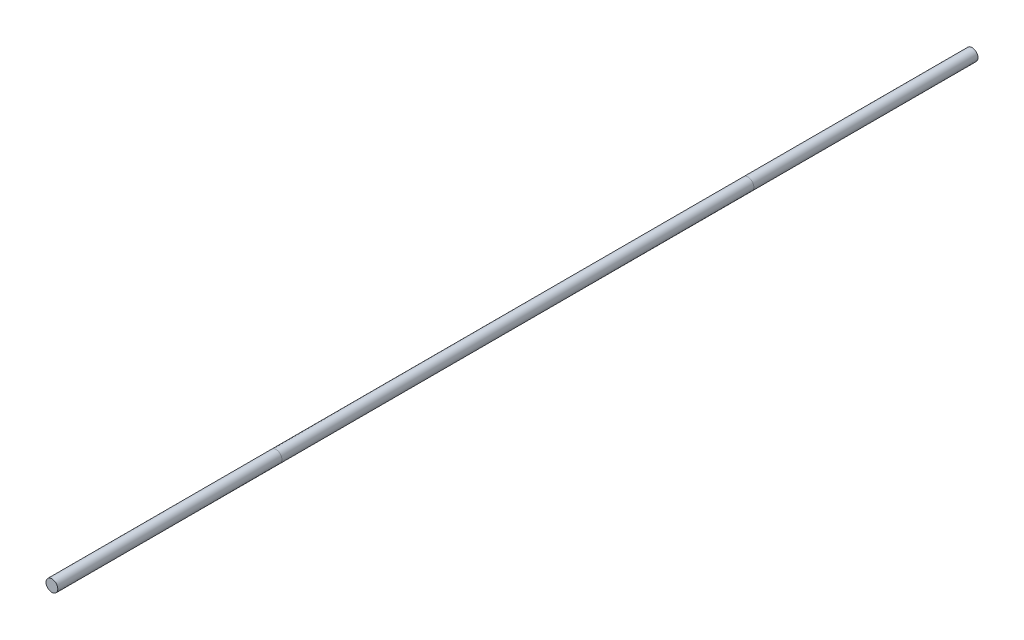
ISO-10303-21;
HEADER;
FILE_DESCRIPTION(('STEP AP214'),'2;1');
FILE_NAME('part.step','',(''),(''),'','','');
FILE_SCHEMA(('AUTOMOTIVE_DESIGN { 1 0 10303 214 1 1 1 1 }'));
ENDSEC;
DATA;
#1=APPLICATION_CONTEXT('core data for automotive mechanical design processes');
#2=APPLICATION_PROTOCOL_DEFINITION('international standard','automotive_design',2000,#1);
#3=PRODUCT_CONTEXT('',#1,'mechanical');
#4=PRODUCT('Part','Part','',(#3));
#5=PRODUCT_RELATED_PRODUCT_CATEGORY('part','',(#4));
#6=PRODUCT_DEFINITION_FORMATION('','',#4);
#7=PRODUCT_DEFINITION_CONTEXT('part definition',#1,'design');
#8=PRODUCT_DEFINITION('design','',#6,#7);
#9=PRODUCT_DEFINITION_SHAPE('','',#8);
#10=(LENGTH_UNIT() NAMED_UNIT(*) SI_UNIT(.MILLI.,.METRE.));
#11=(NAMED_UNIT(*) PLANE_ANGLE_UNIT() SI_UNIT($,.RADIAN.));
#12=(NAMED_UNIT(*) SI_UNIT($,.STERADIAN.) SOLID_ANGLE_UNIT());
#13=UNCERTAINTY_MEASURE_WITH_UNIT(LENGTH_MEASURE(1.E-05),#10,'distance_accuracy_value','');
#14=(GEOMETRIC_REPRESENTATION_CONTEXT(3) GLOBAL_UNCERTAINTY_ASSIGNED_CONTEXT((#13)) GLOBAL_UNIT_ASSIGNED_CONTEXT((#10,
#11,#12)) REPRESENTATION_CONTEXT('',''));
#15=CARTESIAN_POINT('',(0.,0.,0.));
#16=DIRECTION('',(0.,0.,1.));
#17=DIRECTION('',(1.,0.,0.));
#18=AXIS2_PLACEMENT_3D('',#15,#16,#17);
#19=CARTESIAN_POINT('',(0.,0.,247.65));
#20=DIRECTION('',(0.,0.,-1.));
#21=DIRECTION('',(-1.,0.,0.));
#22=AXIS2_PLACEMENT_3D('',#19,#20,#21);
#23=CYLINDRICAL_SURFACE('',#22,3.175);
#24=CARTESIAN_POINT('',(0.,0.,127.));
#25=DIRECTION('',(0.,0.,1.));
#26=DIRECTION('',(1.,0.,0.));
#27=AXIS2_PLACEMENT_3D('',#24,#25,#26);
#28=CIRCLE('',#27,3.175);
#29=CARTESIAN_POINT('',(3.175,0.,127.));
#30=VERTEX_POINT('',#29);
#31=EDGE_CURVE('E53',#30,#30,#28,.T.);
#32=ORIENTED_EDGE('',*,*,#31,.F.);
#33=EDGE_LOOP('',(#32));
#34=FACE_BOUND('',#33,.T.);
#35=CARTESIAN_POINT('',(0.,0.,-127.));
#36=DIRECTION('',(0.,0.,1.));
#37=DIRECTION('',(1.,0.,0.));
#38=AXIS2_PLACEMENT_3D('',#35,#36,#37);
#39=CIRCLE('',#38,3.175);
#40=CARTESIAN_POINT('',(3.175,0.,-127.));
#41=VERTEX_POINT('',#40);
#42=EDGE_CURVE('E11',#41,#41,#39,.T.);
#43=ORIENTED_EDGE('',*,*,#42,.T.);
#44=EDGE_LOOP('',(#43));
#45=FACE_BOUND('',#44,.T.);
#46=ADVANCED_FACE('F46',(#34,#45),#23,.T.);
#47=CARTESIAN_POINT('',(0.,0.,247.65));
#48=DIRECTION('',(0.,0.,1.));
#49=DIRECTION('',(1.,0.,0.));
#50=AXIS2_PLACEMENT_3D('',#47,#48,#49);
#51=CIRCLE('',#50,3.175);
#52=CARTESIAN_POINT('',(3.175,0.,247.65));
#53=VERTEX_POINT('',#52);
#54=EDGE_CURVE('E57',#53,#53,#51,.T.);
#55=ORIENTED_EDGE('',*,*,#54,.F.);
#56=EDGE_LOOP('',(#55));
#57=FACE_BOUND('',#56,.T.);
#58=ORIENTED_EDGE('',*,*,#31,.T.);
#59=EDGE_LOOP('',(#58));
#60=FACE_BOUND('',#59,.T.);
#61=ADVANCED_FACE('F77',(#57,#60),#23,.T.);
#62=ORIENTED_EDGE('',*,*,#42,.F.);
#63=EDGE_LOOP('',(#62));
#64=FACE_BOUND('',#63,.T.);
#65=CARTESIAN_POINT('',(0.,0.,-247.65));
#66=DIRECTION('',(0.,0.,1.));
#67=DIRECTION('',(1.,0.,0.));
#68=AXIS2_PLACEMENT_3D('',#65,#66,#67);
#69=CIRCLE('',#68,3.175);
#70=CARTESIAN_POINT('',(3.175,0.,-247.65));
#71=VERTEX_POINT('',#70);
#72=EDGE_CURVE('E61',#71,#71,#69,.T.);
#73=ORIENTED_EDGE('',*,*,#72,.T.);
#74=EDGE_LOOP('',(#73));
#75=FACE_BOUND('',#74,.T.);
#76=ADVANCED_FACE('F48',(#64,#75),#23,.T.);
#77=CARTESIAN_POINT('',(0.,0.,247.65));
#78=DIRECTION('',(0.,0.,1.));
#79=DIRECTION('',(1.,0.,0.));
#80=AXIS2_PLACEMENT_3D('',#77,#78,#79);
#81=PLANE('',#80);
#82=ORIENTED_EDGE('',*,*,#54,.T.);
#83=EDGE_LOOP('',(#82));
#84=FACE_BOUND('',#83,.T.);
#85=ADVANCED_FACE('F70',(#84),#81,.T.);
#86=CARTESIAN_POINT('',(0.,0.,-247.65));
#87=DIRECTION('',(0.,0.,1.));
#88=DIRECTION('',(1.,0.,0.));
#89=AXIS2_PLACEMENT_3D('',#86,#87,#88);
#90=PLANE('',#89);
#91=ORIENTED_EDGE('',*,*,#72,.F.);
#92=EDGE_LOOP('',(#91));
#93=FACE_BOUND('',#92,.T.);
#94=ADVANCED_FACE('F68',(#93),#90,.F.);
#95=CLOSED_SHELL('',(#46,#61,#76,#85,#94));
#96=MANIFOLD_SOLID_BREP('B2',#95);
#97=ADVANCED_BREP_SHAPE_REPRESENTATION('',(#18,#96),#14);
#98=SHAPE_DEFINITION_REPRESENTATION(#9,#97);
ENDSEC;
END-ISO-10303-21;
